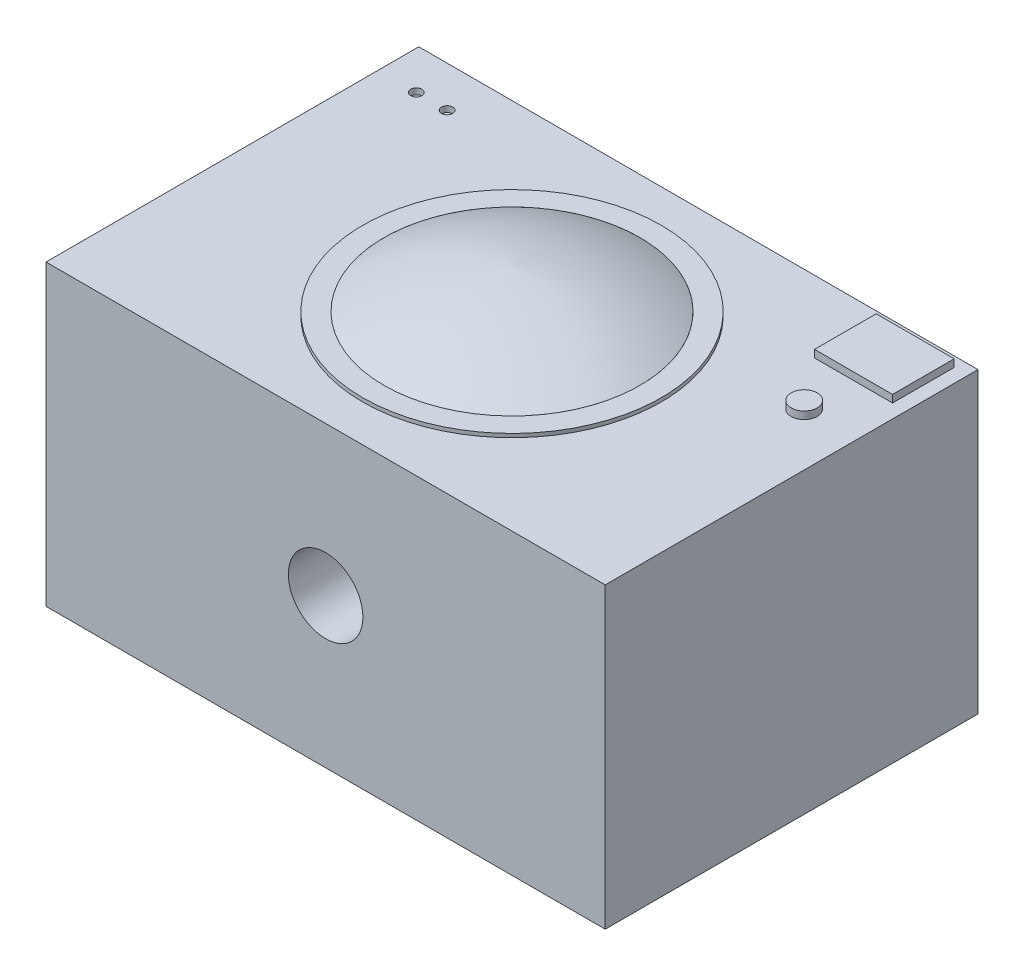
ISO-10303-21;
HEADER;
FILE_DESCRIPTION(('STEP AP214'),'2;1');
FILE_NAME('part.step','',(''),(''),'','','');
FILE_SCHEMA(('AUTOMOTIVE_DESIGN { 1 0 10303 214 1 1 1 1 }'));
ENDSEC;
DATA;
#1=APPLICATION_CONTEXT('core data for automotive mechanical design processes');
#2=APPLICATION_PROTOCOL_DEFINITION('international standard','automotive_design',2000,#1);
#3=PRODUCT_CONTEXT('',#1,'mechanical');
#4=PRODUCT('Part','Part','',(#3));
#5=PRODUCT_RELATED_PRODUCT_CATEGORY('part','',(#4));
#6=PRODUCT_DEFINITION_FORMATION('','',#4);
#7=PRODUCT_DEFINITION_CONTEXT('part definition',#1,'design');
#8=PRODUCT_DEFINITION('design','',#6,#7);
#9=PRODUCT_DEFINITION_SHAPE('','',#8);
#10=(LENGTH_UNIT() NAMED_UNIT(*) SI_UNIT(.MILLI.,.METRE.));
#11=(NAMED_UNIT(*) PLANE_ANGLE_UNIT() SI_UNIT($,.RADIAN.));
#12=(NAMED_UNIT(*) SI_UNIT($,.STERADIAN.) SOLID_ANGLE_UNIT());
#13=UNCERTAINTY_MEASURE_WITH_UNIT(LENGTH_MEASURE(1.E-05),#10,'distance_accuracy_value','');
#14=(GEOMETRIC_REPRESENTATION_CONTEXT(3) GLOBAL_UNCERTAINTY_ASSIGNED_CONTEXT((#13)) GLOBAL_UNIT_ASSIGNED_CONTEXT((#10,
#11,#12)) REPRESENTATION_CONTEXT('',''));
#15=CARTESIAN_POINT('',(0.,0.,0.));
#16=DIRECTION('',(0.,0.,1.));
#17=DIRECTION('',(1.,0.,0.));
#18=AXIS2_PLACEMENT_3D('',#15,#16,#17);
#19=CARTESIAN_POINT('',(0.,40.,0.));
#20=DIRECTION('',(0.,1.,0.));
#21=DIRECTION('',(0.,0.,1.));
#22=AXIS2_PLACEMENT_3D('',#19,#20,#21);
#23=CONICAL_SURFACE('',#22,0.,1.54167896286986);
#24=CARTESIAN_POINT('',(0.,40.5,0.));
#25=DIRECTION('',(0.,-1.,0.));
#26=DIRECTION('',(0.,0.,-1.));
#27=AXIS2_PLACEMENT_3D('',#24,#25,#26);
#28=CIRCLE('',#27,17.1670309791528);
#29=CARTESIAN_POINT('',(0.,40.5,-17.1670309791528));
#30=VERTEX_POINT('',#29);
#31=EDGE_CURVE('E12',#30,#30,#28,.T.);
#32=ORIENTED_EDGE('',*,*,#31,.T.);
#33=EDGE_LOOP('',(#32));
#34=FACE_BOUND('',#33,.T.);
#35=CARTESIAN_POINT('',(0.,40.,0.));
#36=VERTEX_POINT('',#35);
#37=VERTEX_LOOP('',#36);
#38=FACE_BOUND('',#37,.T.);
#39=ADVANCED_FACE('F44',(#34,#38),#23,.T.);
#40=CARTESIAN_POINT('',(0.,5.53865891644741,2.65672331871384));
#41=DIRECTION('',(-1.,0.,0.));
#42=DIRECTION('',(0.,0.,-1.));
#43=AXIS2_PLACEMENT_3D('',#40,#41,#42);
#44=CIRCLE('',#43,40.1905039135203);
#45=TRIMMED_CURVE('',#44,(PARAMETER_VALUE(-1.50464483090823)),
(PARAMETER_VALUE(1.50464483090823)),.T.,.PARAMETER.);
#46=CARTESIAN_POINT('',(0.,5.53865891644741,0.));
#47=DIRECTION('',(0.,-1.,0.));
#48=AXIS1_PLACEMENT('',#46,#47);
#49=SURFACE_OF_REVOLUTION('',#45,#48);
#50=CARTESIAN_POINT('',(0.,45.6412576605499,0.));
#51=VERTEX_POINT('',#50);
#52=VERTEX_LOOP('',#51);
#53=FACE_BOUND('',#52,.T.);
#54=ORIENTED_EDGE('',*,*,#31,.F.);
#55=EDGE_LOOP('',(#54));
#56=FACE_BOUND('',#55,.T.);
#57=ADVANCED_FACE('F55',(#53,#56),#49,.T.);
#58=CLOSED_SHELL('',(#39,#57));
#59=MANIFOLD_SOLID_BREP('B2',#58);
#60=CARTESIAN_POINT('',(0.,40.,0.));
#61=DIRECTION('',(0.,1.,0.));
#62=DIRECTION('',(0.,0.,1.));
#63=AXIS2_PLACEMENT_3D('',#60,#61,#62);
#64=PLANE('',#63);
#65=CARTESIAN_POINT('',(-32.3631246774455,40.,-19.5273741004889));
#66=DIRECTION('',(0.,1.,0.));
#67=DIRECTION('',(0.,0.,1.));
#68=AXIS2_PLACEMENT_3D('',#65,#66,#67);
#69=CIRCLE('',#68,0.749999999999999);
#70=CARTESIAN_POINT('',(-32.3631246774455,40.,-18.7773741004889));
#71=VERTEX_POINT('',#70);
#72=EDGE_CURVE('E380',#71,#71,#69,.T.);
#73=ORIENTED_EDGE('',*,*,#72,.F.);
#74=EDGE_LOOP('',(#73));
#75=FACE_BOUND('',#74,.T.);
#76=CARTESIAN_POINT('',(-28.2264846810803,40.,-19.5273741004889));
#77=DIRECTION('',(0.,1.,0.));
#78=DIRECTION('',(0.,0.,1.));
#79=AXIS2_PLACEMENT_3D('',#76,#77,#78);
#80=CIRCLE('',#79,0.750000000000002);
#81=CARTESIAN_POINT('',(-28.2264846810803,40.,-18.7773741004889));
#82=VERTEX_POINT('',#81);
#83=EDGE_CURVE('E369',#82,#82,#80,.T.);
#84=ORIENTED_EDGE('',*,*,#83,.F.);
#85=EDGE_LOOP('',(#84));
#86=FACE_BOUND('',#85,.T.);
#87=CARTESIAN_POINT('',(30.416470561509,40.,-8.77425715492008));
#88=DIRECTION('',(0.,1.,0.));
#89=DIRECTION('',(0.,0.,1.));
#90=AXIS2_PLACEMENT_3D('',#87,#88,#89);
#91=CIRCLE('',#90,1.75);
#92=CARTESIAN_POINT('',(30.416470561509,40.,-7.02425715492007));
#93=VERTEX_POINT('',#92);
#94=EDGE_CURVE('E379',#93,#93,#91,.T.);
#95=ORIENTED_EDGE('',*,*,#94,.F.);
#96=EDGE_LOOP('',(#95));
#97=FACE_BOUND('',#96,.T.);
#98=CARTESIAN_POINT('',(0.,40.,0.));
#99=DIRECTION('',(0.,1.,0.));
#100=DIRECTION('',(0.,0.,1.));
#101=AXIS2_PLACEMENT_3D('',#98,#99,#100);
#102=CIRCLE('',#101,20.0265797079087);
#103=CARTESIAN_POINT('',(0.,40.,20.0265797079087));
#104=VERTEX_POINT('',#103);
#105=EDGE_CURVE('E429',#104,#104,#102,.T.);
#106=ORIENTED_EDGE('',*,*,#105,.F.);
#107=EDGE_LOOP('',(#106));
#108=FACE_BOUND('',#107,.T.);
#109=DIRECTION('',(0.,0.,-1.));
#110=VECTOR('',#109,1.);
#111=CARTESIAN_POINT('',(37.5,40.,-25.));
#112=LINE('',#111,#110);
#113=CARTESIAN_POINT('',(37.5,40.,25.));
#114=VERTEX_POINT('',#113);
#115=CARTESIAN_POINT('',(37.5,40.,-25.));
#116=VERTEX_POINT('',#115);
#117=EDGE_CURVE('E436',#114,#116,#112,.T.);
#118=ORIENTED_EDGE('',*,*,#117,.T.);
#119=DIRECTION('',(-1.,0.,0.));
#120=VECTOR('',#119,1.);
#121=CARTESIAN_POINT('',(-37.5,40.,-25.));
#122=LINE('',#121,#120);
#123=CARTESIAN_POINT('',(-37.5,40.,-25.));
#124=VERTEX_POINT('',#123);
#125=EDGE_CURVE('E439',#116,#124,#122,.T.);
#126=ORIENTED_EDGE('',*,*,#125,.T.);
#127=DIRECTION('',(0.,0.,1.));
#128=VECTOR('',#127,1.);
#129=CARTESIAN_POINT('',(-37.5,40.,-25.));
#130=LINE('',#129,#128);
#131=CARTESIAN_POINT('',(-37.5,40.,25.));
#132=VERTEX_POINT('',#131);
#133=EDGE_CURVE('E442',#124,#132,#130,.T.);
#134=ORIENTED_EDGE('',*,*,#133,.T.);
#135=DIRECTION('',(1.,0.,0.));
#136=VECTOR('',#135,1.);
#137=CARTESIAN_POINT('',(-37.5,40.,25.));
#138=LINE('',#137,#136);
#139=EDGE_CURVE('E444',#132,#114,#138,.T.);
#140=ORIENTED_EDGE('',*,*,#139,.T.);
#141=EDGE_LOOP('',(#118,#126,#134,#140));
#142=FACE_BOUND('',#141,.T.);
#143=DIRECTION('',(0.,0.,-1.));
#144=VECTOR('',#143,1.);
#145=CARTESIAN_POINT('',(35.6481034980885,40.,0.));
#146=LINE('',#145,#144);
#147=CARTESIAN_POINT('',(35.6481034980885,40.,-15.3907341041236));
#148=VERTEX_POINT('',#147);
#149=CARTESIAN_POINT('',(35.6481034980885,40.,-23.6640140968541));
#150=VERTEX_POINT('',#149);
#151=EDGE_CURVE('E409',#148,#150,#146,.T.);
#152=ORIENTED_EDGE('',*,*,#151,.F.);
#153=DIRECTION('',(1.,0.,0.));
#154=VECTOR('',#153,1.);
#155=CARTESIAN_POINT('',(0.,40.,-15.3907341041236));
#156=LINE('',#155,#154);
#157=CARTESIAN_POINT('',(25.1848376249294,40.,-15.3907341041236));
#158=VERTEX_POINT('',#157);
#159=EDGE_CURVE('E391',#158,#148,#156,.T.);
#160=ORIENTED_EDGE('',*,*,#159,.F.);
#161=DIRECTION('',(0.,0.,-1.));
#162=VECTOR('',#161,1.);
#163=CARTESIAN_POINT('',(25.1848376249294,40.,0.));
#164=LINE('',#163,#162);
#165=CARTESIAN_POINT('',(25.1848376249294,40.,-23.6640140968541));
#166=VERTEX_POINT('',#165);
#167=EDGE_CURVE('E398',#158,#166,#164,.T.);
#168=ORIENTED_EDGE('',*,*,#167,.T.);
#169=DIRECTION('',(1.,0.,0.));
#170=VECTOR('',#169,1.);
#171=CARTESIAN_POINT('',(0.,40.,-23.6640140968541));
#172=LINE('',#171,#170);
#173=EDGE_CURVE('E412',#166,#150,#172,.T.);
#174=ORIENTED_EDGE('',*,*,#173,.T.);
#175=EDGE_LOOP('',(#152,#160,#168,#174));
#176=FACE_BOUND('',#175,.T.);
#177=ADVANCED_FACE('F75',(#75,#86,#97,#108,#142,#176),#64,.T.);
#178=CARTESIAN_POINT('',(37.5,40.,-25.));
#179=DIRECTION('',(-1.,0.,0.));
#180=DIRECTION('',(0.,0.,1.));
#181=AXIS2_PLACEMENT_3D('',#178,#179,#180);
#182=PLANE('',#181);
#183=DIRECTION('',(0.,0.,-1.));
#184=VECTOR('',#183,1.);
#185=CARTESIAN_POINT('',(37.5,0.,-25.));
#186=LINE('',#185,#184);
#187=CARTESIAN_POINT('',(37.5,0.,25.));
#188=VERTEX_POINT('',#187);
#189=CARTESIAN_POINT('',(37.5,0.,-25.));
#190=VERTEX_POINT('',#189);
#191=EDGE_CURVE('E433',#188,#190,#186,.T.);
#192=ORIENTED_EDGE('',*,*,#191,.T.);
#193=DIRECTION('',(0.,-1.,0.));
#194=VECTOR('',#193,1.);
#195=CARTESIAN_POINT('',(37.5,40.,-25.));
#196=LINE('',#195,#194);
#197=EDGE_CURVE('E83',#116,#190,#196,.T.);
#198=ORIENTED_EDGE('',*,*,#197,.F.);
#199=ORIENTED_EDGE('',*,*,#117,.F.);
#200=DIRECTION('',(0.,-1.,0.));
#201=VECTOR('',#200,1.);
#202=CARTESIAN_POINT('',(37.5,40.,25.));
#203=LINE('',#202,#201);
#204=EDGE_CURVE('E446',#114,#188,#203,.T.);
#205=ORIENTED_EDGE('',*,*,#204,.T.);
#206=EDGE_LOOP('',(#192,#198,#199,#205));
#207=FACE_BOUND('',#206,.T.);
#208=ADVANCED_FACE('F77',(#207),#182,.F.);
#209=CARTESIAN_POINT('',(-37.5,40.,-25.));
#210=DIRECTION('',(0.,0.,1.));
#211=DIRECTION('',(1.,0.,0.));
#212=AXIS2_PLACEMENT_3D('',#209,#210,#211);
#213=PLANE('',#212);
#214=DIRECTION('',(1.,0.,0.));
#215=VECTOR('',#214,1.);
#216=CARTESIAN_POINT('',(36.7430964383028,6.21323590369122,-25.));
#217=LINE('',#216,#215);
#218=CARTESIAN_POINT('',(-36.7430964383028,6.21323590369122,-25.));
#219=VERTEX_POINT('',#218);
#220=CARTESIAN_POINT('',(36.7430964383028,6.21323590369122,-25.));
#221=VERTEX_POINT('',#220);
#222=EDGE_CURVE('E297',#219,#221,#217,.T.);
#223=ORIENTED_EDGE('',*,*,#222,.F.);
#224=DIRECTION('',(0.,1.,0.));
#225=VECTOR('',#224,1.);
#226=CARTESIAN_POINT('',(-36.7430964383028,5.23990884572295,-25.));
#227=LINE('',#226,#225);
#228=CARTESIAN_POINT('',(-36.7430964383028,5.23990884572295,-25.));
#229=VERTEX_POINT('',#228);
#230=EDGE_CURVE('E98',#229,#219,#227,.T.);
#231=ORIENTED_EDGE('',*,*,#230,.F.);
#232=DIRECTION('',(-1.,0.,0.));
#233=VECTOR('',#232,1.);
#234=CARTESIAN_POINT('',(36.7430964383028,5.23990884572295,-25.));
#235=LINE('',#234,#233);
#236=CARTESIAN_POINT('',(36.7430964383028,5.23990884572295,-25.));
#237=VERTEX_POINT('',#236);
#238=EDGE_CURVE('E286',#237,#229,#235,.T.);
#239=ORIENTED_EDGE('',*,*,#238,.F.);
#240=DIRECTION('',(0.,-1.,0.));
#241=VECTOR('',#240,1.);
#242=CARTESIAN_POINT('',(36.7430964383028,5.23990884572295,-25.));
#243=LINE('',#242,#241);
#244=EDGE_CURVE('E301',#221,#237,#243,.T.);
#245=ORIENTED_EDGE('',*,*,#244,.F.);
#246=EDGE_LOOP('',(#223,#231,#239,#245));
#247=FACE_BOUND('',#246,.T.);
#248=DIRECTION('',(-1.,0.,0.));
#249=VECTOR('',#248,1.);
#250=CARTESIAN_POINT('',(34.2807222457032,6.93276215958801,-25.));
#251=LINE('',#250,#249);
#252=CARTESIAN_POINT('',(34.2807222457032,6.93276215958801,-25.));
#253=VERTEX_POINT('',#252);
#254=CARTESIAN_POINT('',(15.3504714718765,6.93276215958801,-25.));
#255=VERTEX_POINT('',#254);
#256=EDGE_CURVE('E329',#253,#255,#251,.T.);
#257=ORIENTED_EDGE('',*,*,#256,.F.);
#258=DIRECTION('',(0.,-1.,0.));
#259=VECTOR('',#258,1.);
#260=CARTESIAN_POINT('',(34.2807222457032,6.93276215958801,-25.));
#261=LINE('',#260,#259);
#262=CARTESIAN_POINT('',(34.2807222457032,14.9361846386489,-25.));
#263=VERTEX_POINT('',#262);
#264=EDGE_CURVE('E278',#263,#253,#261,.T.);
#265=ORIENTED_EDGE('',*,*,#264,.F.);
#266=DIRECTION('',(1.,0.,0.));
#267=VECTOR('',#266,1.);
#268=CARTESIAN_POINT('',(34.2807222457032,14.9361846386489,-25.));
#269=LINE('',#268,#267);
#270=CARTESIAN_POINT('',(15.3504714718765,14.9361846386489,-25.));
#271=VERTEX_POINT('',#270);
#272=EDGE_CURVE('E318',#271,#263,#269,.T.);
#273=ORIENTED_EDGE('',*,*,#272,.F.);
#274=DIRECTION('',(0.,1.,0.));
#275=VECTOR('',#274,1.);
#276=CARTESIAN_POINT('',(15.3504714718765,6.93276215958801,-25.));
#277=LINE('',#276,#275);
#278=EDGE_CURVE('E332',#255,#271,#277,.T.);
#279=ORIENTED_EDGE('',*,*,#278,.F.);
#280=EDGE_LOOP('',(#257,#265,#273,#279));
#281=FACE_BOUND('',#280,.T.);
#282=DIRECTION('',(-1.,0.,0.));
#283=VECTOR('',#282,1.);
#284=CARTESIAN_POINT('',(-37.5,0.,-25.));
#285=LINE('',#284,#283);
#286=CARTESIAN_POINT('',(-37.5,0.,-25.));
#287=VERTEX_POINT('',#286);
#288=EDGE_CURVE('E449',#190,#287,#285,.T.);
#289=ORIENTED_EDGE('',*,*,#288,.T.);
#290=DIRECTION('',(0.,-1.,0.));
#291=VECTOR('',#290,1.);
#292=CARTESIAN_POINT('',(-37.5,40.,-25.));
#293=LINE('',#292,#291);
#294=EDGE_CURVE('E459',#124,#287,#293,.T.);
#295=ORIENTED_EDGE('',*,*,#294,.F.);
#296=ORIENTED_EDGE('',*,*,#125,.F.);
#297=ORIENTED_EDGE('',*,*,#197,.T.);
#298=EDGE_LOOP('',(#289,#295,#296,#297));
#299=FACE_BOUND('',#298,.T.);
#300=ADVANCED_FACE('F464',(#247,#281,#299),#213,.F.);
#301=CARTESIAN_POINT('',(-37.5,40.,-25.));
#302=DIRECTION('',(1.,0.,0.));
#303=DIRECTION('',(0.,0.,-1.));
#304=AXIS2_PLACEMENT_3D('',#301,#302,#303);
#305=PLANE('',#304);
#306=DIRECTION('',(0.,0.,1.));
#307=VECTOR('',#306,1.);
#308=CARTESIAN_POINT('',(-37.5,12.9994691050974,-23.6665995328675));
#309=LINE('',#308,#307);
#310=CARTESIAN_POINT('',(-37.5,12.9994691050974,-23.6665995328675));
#311=VERTEX_POINT('',#310);
#312=CARTESIAN_POINT('',(-37.5,12.9994691050974,23.474967147986));
#313=VERTEX_POINT('',#312);
#314=EDGE_CURVE('E271',#311,#313,#309,.T.);
#315=ORIENTED_EDGE('',*,*,#314,.F.);
#316=DIRECTION('',(0.,-1.,0.));
#317=VECTOR('',#316,1.);
#318=CARTESIAN_POINT('',(-37.5,25.4555741223961,-23.6665995328675));
#319=LINE('',#318,#317);
#320=CARTESIAN_POINT('',(-37.5,25.4555741223961,-23.6665995328675));
#321=VERTEX_POINT('',#320);
#322=EDGE_CURVE('E90',#321,#311,#319,.T.);
#323=ORIENTED_EDGE('',*,*,#322,.F.);
#324=DIRECTION('',(0.,0.,-1.));
#325=VECTOR('',#324,1.);
#326=CARTESIAN_POINT('',(-37.5,25.4555741223961,-23.6665995328675));
#327=LINE('',#326,#325);
#328=CARTESIAN_POINT('',(-37.5,25.4555741223961,23.474967147986));
#329=VERTEX_POINT('',#328);
#330=EDGE_CURVE('E259',#329,#321,#327,.T.);
#331=ORIENTED_EDGE('',*,*,#330,.F.);
#332=DIRECTION('',(0.,1.,0.));
#333=VECTOR('',#332,1.);
#334=CARTESIAN_POINT('',(-37.5,25.4555741223961,23.474967147986));
#335=LINE('',#334,#333);
#336=EDGE_CURVE('E262',#313,#329,#335,.T.);
#337=ORIENTED_EDGE('',*,*,#336,.F.);
#338=EDGE_LOOP('',(#315,#323,#331,#337));
#339=FACE_BOUND('',#338,.T.);
#340=DIRECTION('',(0.,0.,1.));
#341=VECTOR('',#340,1.);
#342=CARTESIAN_POINT('',(-37.5,0.,-25.));
#343=LINE('',#342,#341);
#344=CARTESIAN_POINT('',(-37.5,0.,25.));
#345=VERTEX_POINT('',#344);
#346=EDGE_CURVE('E451',#287,#345,#343,.T.);
#347=ORIENTED_EDGE('',*,*,#346,.T.);
#348=DIRECTION('',(0.,-1.,0.));
#349=VECTOR('',#348,1.);
#350=CARTESIAN_POINT('',(-37.5,40.,25.));
#351=LINE('',#350,#349);
#352=EDGE_CURVE('E456',#132,#345,#351,.T.);
#353=ORIENTED_EDGE('',*,*,#352,.F.);
#354=ORIENTED_EDGE('',*,*,#133,.F.);
#355=ORIENTED_EDGE('',*,*,#294,.T.);
#356=EDGE_LOOP('',(#347,#353,#354,#355));
#357=FACE_BOUND('',#356,.T.);
#358=ADVANCED_FACE('F476',(#339,#357),#305,.F.);
#359=CARTESIAN_POINT('',(-37.5,40.,25.));
#360=DIRECTION('',(0.,0.,-1.));
#361=DIRECTION('',(-1.,0.,0.));
#362=AXIS2_PLACEMENT_3D('',#359,#360,#361);
#363=PLANE('',#362);
#364=CARTESIAN_POINT('',(0.,20.,25.));
#365=DIRECTION('',(0.,0.,1.));
#366=DIRECTION('',(1.,0.,0.));
#367=AXIS2_PLACEMENT_3D('',#364,#365,#366);
#368=CIRCLE('',#367,5.);
#369=CARTESIAN_POINT('',(4.99999999999999,20.,25.));
#370=VERTEX_POINT('',#369);
#371=EDGE_CURVE('E265',#370,#370,#368,.T.);
#372=ORIENTED_EDGE('',*,*,#371,.F.);
#373=EDGE_LOOP('',(#372));
#374=FACE_BOUND('',#373,.T.);
#375=DIRECTION('',(1.,0.,0.));
#376=VECTOR('',#375,1.);
#377=CARTESIAN_POINT('',(-37.5,0.,25.));
#378=LINE('',#377,#376);
#379=EDGE_CURVE('E440',#345,#188,#378,.T.);
#380=ORIENTED_EDGE('',*,*,#379,.T.);
#381=ORIENTED_EDGE('',*,*,#204,.F.);
#382=ORIENTED_EDGE('',*,*,#139,.F.);
#383=ORIENTED_EDGE('',*,*,#352,.T.);
#384=EDGE_LOOP('',(#380,#381,#382,#383));
#385=FACE_BOUND('',#384,.T.);
#386=ADVANCED_FACE('F480',(#374,#385),#363,.F.);
#387=CARTESIAN_POINT('',(0.,0.,0.));
#388=DIRECTION('',(0.,1.,0.));
#389=DIRECTION('',(0.,0.,1.));
#390=AXIS2_PLACEMENT_3D('',#387,#388,#389);
#391=PLANE('',#390);
#392=DIRECTION('',(-1.,0.,0.));
#393=VECTOR('',#392,1.);
#394=CARTESIAN_POINT('',(-34.5522876596546,0.,15.7957752232635));
#395=LINE('',#394,#393);
#396=CARTESIAN_POINT('',(34.5522876596546,0.,15.7957752232635));
#397=VERTEX_POINT('',#396);
#398=CARTESIAN_POINT('',(-34.5522876596546,0.,15.7957752232635));
#399=VERTEX_POINT('',#398);
#400=EDGE_CURVE('E359',#397,#399,#395,.T.);
#401=ORIENTED_EDGE('',*,*,#400,.F.);
#402=DIRECTION('',(0.,0.,1.));
#403=VECTOR('',#402,1.);
#404=CARTESIAN_POINT('',(34.5522876596546,0.,-15.7957752232635));
#405=LINE('',#404,#403);
#406=CARTESIAN_POINT('',(34.5522876596546,0.,-15.7957752232635));
#407=VERTEX_POINT('',#406);
#408=EDGE_CURVE('E308',#407,#397,#405,.T.);
#409=ORIENTED_EDGE('',*,*,#408,.F.);
#410=DIRECTION('',(1.,0.,0.));
#411=VECTOR('',#410,1.);
#412=CARTESIAN_POINT('',(-34.5522876596546,0.,-15.7957752232635));
#413=LINE('',#412,#411);
#414=CARTESIAN_POINT('',(-34.5522876596546,0.,-15.7957752232635));
#415=VERTEX_POINT('',#414);
#416=EDGE_CURVE('E348',#415,#407,#413,.T.);
#417=ORIENTED_EDGE('',*,*,#416,.F.);
#418=DIRECTION('',(0.,0.,-1.));
#419=VECTOR('',#418,1.);
#420=CARTESIAN_POINT('',(-34.5522876596546,0.,-15.7957752232635));
#421=LINE('',#420,#419);
#422=EDGE_CURVE('E362',#399,#415,#421,.T.);
#423=ORIENTED_EDGE('',*,*,#422,.F.);
#424=EDGE_LOOP('',(#401,#409,#417,#423));
#425=FACE_BOUND('',#424,.T.);
#426=ORIENTED_EDGE('',*,*,#191,.F.);
#427=ORIENTED_EDGE('',*,*,#379,.F.);
#428=ORIENTED_EDGE('',*,*,#346,.F.);
#429=ORIENTED_EDGE('',*,*,#288,.F.);
#430=EDGE_LOOP('',(#426,#427,#428,#429));
#431=FACE_BOUND('',#430,.T.);
#432=ADVANCED_FACE('F472',(#425,#431),#391,.F.);
#433=CARTESIAN_POINT('',(0.,40.5,0.));
#434=DIRECTION('',(0.,1.,0.));
#435=DIRECTION('',(0.,0.,1.));
#436=AXIS2_PLACEMENT_3D('',#433,#434,#435);
#437=PLANE('',#436);
#438=CARTESIAN_POINT('',(0.,40.5,0.));
#439=DIRECTION('',(0.,1.,0.));
#440=DIRECTION('',(0.,0.,1.));
#441=AXIS2_PLACEMENT_3D('',#438,#439,#440);
#442=CIRCLE('',#441,20.0265797079087);
#443=CARTESIAN_POINT('',(0.,40.5,20.0265797079087));
#444=VERTEX_POINT('',#443);
#445=EDGE_CURVE('E430',#444,#444,#442,.T.);
#446=ORIENTED_EDGE('',*,*,#445,.T.);
#447=EDGE_LOOP('',(#446));
#448=FACE_BOUND('',#447,.T.);
#449=CARTESIAN_POINT('',(0.,40.5,0.));
#450=DIRECTION('',(0.,1.,0.));
#451=DIRECTION('',(0.,0.,1.));
#452=AXIS2_PLACEMENT_3D('',#449,#450,#451);
#453=CIRCLE('',#452,17.1670309791528);
#454=CARTESIAN_POINT('',(0.,40.5,17.1670309791528));
#455=VERTEX_POINT('',#454);
#456=EDGE_CURVE('E426',#455,#455,#453,.T.);
#457=ORIENTED_EDGE('',*,*,#456,.F.);
#458=EDGE_LOOP('',(#457));
#459=FACE_BOUND('',#458,.T.);
#460=ADVANCED_FACE('F528',(#448,#459),#437,.T.);
#461=CARTESIAN_POINT('',(0.,40.5,0.));
#462=DIRECTION('',(0.,-1.,0.));
#463=DIRECTION('',(0.,0.,-1.));
#464=AXIS2_PLACEMENT_3D('',#461,#462,#463);
#465=CYLINDRICAL_SURFACE('',#464,20.0265797079087);
#466=ORIENTED_EDGE('',*,*,#445,.F.);
#467=EDGE_LOOP('',(#466));
#468=FACE_BOUND('',#467,.T.);
#469=ORIENTED_EDGE('',*,*,#105,.T.);
#470=EDGE_LOOP('',(#469));
#471=FACE_BOUND('',#470,.T.);
#472=ADVANCED_FACE('F526',(#468,#471),#465,.T.);
#473=CARTESIAN_POINT('',(0.,40.5,0.));
#474=DIRECTION('',(0.,-1.,0.));
#475=DIRECTION('',(0.,0.,-1.));
#476=AXIS2_PLACEMENT_3D('',#473,#474,#475);
#477=CYLINDRICAL_SURFACE('',#476,17.1670309791528);
#478=ORIENTED_EDGE('',*,*,#456,.T.);
#479=EDGE_LOOP('',(#478));
#480=FACE_BOUND('',#479,.T.);
#481=CARTESIAN_POINT('',(0.,40.,0.));
#482=DIRECTION('',(0.,1.,0.));
#483=DIRECTION('',(0.,0.,1.));
#484=AXIS2_PLACEMENT_3D('',#481,#482,#483);
#485=CIRCLE('',#484,17.1670309791528);
#486=CARTESIAN_POINT('',(0.,40.,17.1670309791528));
#487=VERTEX_POINT('',#486);
#488=EDGE_CURVE('E42',#487,#487,#485,.F.);
#489=ORIENTED_EDGE('',*,*,#488,.T.);
#490=EDGE_LOOP('',(#489));
#491=FACE_BOUND('',#490,.T.);
#492=ADVANCED_FACE('F523',(#480,#491),#477,.F.);
#493=CARTESIAN_POINT('',(0.,40.,0.));
#494=VERTEX_POINT('',#493);
#495=VERTEX_LOOP('',#494);
#496=FACE_BOUND('',#495,.T.);
#497=ORIENTED_EDGE('',*,*,#488,.F.);
#498=EDGE_LOOP('',(#497));
#499=FACE_BOUND('',#498,.T.);
#500=ADVANCED_FACE('F486',(#496,#499),#64,.T.);
#501=CARTESIAN_POINT('',(0.,41.,-15.3907341041236));
#502=DIRECTION('',(0.,0.,-1.));
#503=DIRECTION('',(-1.,0.,0.));
#504=AXIS2_PLACEMENT_3D('',#501,#502,#503);
#505=PLANE('',#504);
#506=ORIENTED_EDGE('',*,*,#159,.T.);
#507=DIRECTION('',(0.,-1.,0.));
#508=VECTOR('',#507,1.);
#509=CARTESIAN_POINT('',(35.6481034980885,41.,-15.3907341041236));
#510=LINE('',#509,#508);
#511=CARTESIAN_POINT('',(35.6481034980885,41.,-15.3907341041236));
#512=VERTEX_POINT('',#511);
#513=EDGE_CURVE('E423',#512,#148,#510,.T.);
#514=ORIENTED_EDGE('',*,*,#513,.F.);
#515=DIRECTION('',(1.,0.,0.));
#516=VECTOR('',#515,1.);
#517=CARTESIAN_POINT('',(0.,41.,-15.3907341041236));
#518=LINE('',#517,#516);
#519=CARTESIAN_POINT('',(25.1848376249294,41.,-15.3907341041236));
#520=VERTEX_POINT('',#519);
#521=EDGE_CURVE('E394',#520,#512,#518,.T.);
#522=ORIENTED_EDGE('',*,*,#521,.F.);
#523=DIRECTION('',(0.,-1.,0.));
#524=VECTOR('',#523,1.);
#525=CARTESIAN_POINT('',(25.1848376249294,41.,-15.3907341041236));
#526=LINE('',#525,#524);
#527=EDGE_CURVE('E406',#520,#158,#526,.T.);
#528=ORIENTED_EDGE('',*,*,#527,.T.);
#529=EDGE_LOOP('',(#506,#514,#522,#528));
#530=FACE_BOUND('',#529,.T.);
#531=ADVANCED_FACE('F494',(#530),#505,.F.);
#532=CARTESIAN_POINT('',(35.6481034980885,41.,0.));
#533=DIRECTION('',(-1.,0.,0.));
#534=DIRECTION('',(0.,0.,1.));
#535=AXIS2_PLACEMENT_3D('',#532,#533,#534);
#536=PLANE('',#535);
#537=ORIENTED_EDGE('',*,*,#151,.T.);
#538=DIRECTION('',(0.,-1.,0.));
#539=VECTOR('',#538,1.);
#540=CARTESIAN_POINT('',(35.6481034980885,41.,-23.6640140968541));
#541=LINE('',#540,#539);
#542=CARTESIAN_POINT('',(35.6481034980885,41.,-23.6640140968541));
#543=VERTEX_POINT('',#542);
#544=EDGE_CURVE('E420',#543,#150,#541,.T.);
#545=ORIENTED_EDGE('',*,*,#544,.F.);
#546=DIRECTION('',(0.,0.,-1.));
#547=VECTOR('',#546,1.);
#548=CARTESIAN_POINT('',(35.6481034980885,41.,0.));
#549=LINE('',#548,#547);
#550=EDGE_CURVE('E397',#512,#543,#549,.T.);
#551=ORIENTED_EDGE('',*,*,#550,.F.);
#552=ORIENTED_EDGE('',*,*,#513,.T.);
#553=EDGE_LOOP('',(#537,#545,#551,#552));
#554=FACE_BOUND('',#553,.T.);
#555=ADVANCED_FACE('F491',(#554),#536,.F.);
#556=CARTESIAN_POINT('',(0.,41.,-23.6640140968541));
#557=DIRECTION('',(0.,0.,-1.));
#558=DIRECTION('',(-1.,0.,0.));
#559=AXIS2_PLACEMENT_3D('',#556,#557,#558);
#560=PLANE('',#559);
#561=ORIENTED_EDGE('',*,*,#173,.F.);
#562=DIRECTION('',(0.,-1.,0.));
#563=VECTOR('',#562,1.);
#564=CARTESIAN_POINT('',(25.1848376249294,41.,-23.6640140968541));
#565=LINE('',#564,#563);
#566=CARTESIAN_POINT('',(25.1848376249294,41.,-23.6640140968541));
#567=VERTEX_POINT('',#566);
#568=EDGE_CURVE('E417',#567,#166,#565,.T.);
#569=ORIENTED_EDGE('',*,*,#568,.F.);
#570=DIRECTION('',(1.,0.,0.));
#571=VECTOR('',#570,1.);
#572=CARTESIAN_POINT('',(0.,41.,-23.6640140968541));
#573=LINE('',#572,#571);
#574=EDGE_CURVE('E400',#567,#543,#573,.T.);
#575=ORIENTED_EDGE('',*,*,#574,.T.);
#576=ORIENTED_EDGE('',*,*,#544,.T.);
#577=EDGE_LOOP('',(#561,#569,#575,#576));
#578=FACE_BOUND('',#577,.T.);
#579=ADVANCED_FACE('F501',(#578),#560,.T.);
#580=CARTESIAN_POINT('',(25.1848376249294,41.,0.));
#581=DIRECTION('',(-1.,0.,0.));
#582=DIRECTION('',(0.,0.,1.));
#583=AXIS2_PLACEMENT_3D('',#580,#581,#582);
#584=PLANE('',#583);
#585=ORIENTED_EDGE('',*,*,#167,.F.);
#586=ORIENTED_EDGE('',*,*,#527,.F.);
#587=DIRECTION('',(0.,0.,-1.));
#588=VECTOR('',#587,1.);
#589=CARTESIAN_POINT('',(25.1848376249294,41.,0.));
#590=LINE('',#589,#588);
#591=EDGE_CURVE('E403',#520,#567,#590,.T.);
#592=ORIENTED_EDGE('',*,*,#591,.T.);
#593=ORIENTED_EDGE('',*,*,#568,.T.);
#594=EDGE_LOOP('',(#585,#586,#592,#593));
#595=FACE_BOUND('',#594,.T.);
#596=ADVANCED_FACE('F498',(#595),#584,.T.);
#597=CARTESIAN_POINT('',(0.,41.,0.));
#598=DIRECTION('',(0.,1.,0.));
#599=DIRECTION('',(0.,0.,1.));
#600=AXIS2_PLACEMENT_3D('',#597,#598,#599);
#601=PLANE('',#600);
#602=ORIENTED_EDGE('',*,*,#521,.T.);
#603=ORIENTED_EDGE('',*,*,#550,.T.);
#604=ORIENTED_EDGE('',*,*,#574,.F.);
#605=ORIENTED_EDGE('',*,*,#591,.F.);
#606=EDGE_LOOP('',(#602,#603,#604,#605));
#607=FACE_BOUND('',#606,.T.);
#608=ADVANCED_FACE('F503',(#607),#601,.T.);
#609=CARTESIAN_POINT('',(30.416470561509,41.,-8.77425715492008));
#610=DIRECTION('',(0.,-1.,0.));
#611=DIRECTION('',(0.,0.,-1.));
#612=AXIS2_PLACEMENT_3D('',#609,#610,#611);
#613=CYLINDRICAL_SURFACE('',#612,1.75);
#614=CARTESIAN_POINT('',(30.416470561509,41.,-8.77425715492008));
#615=DIRECTION('',(0.,1.,0.));
#616=DIRECTION('',(0.,0.,1.));
#617=AXIS2_PLACEMENT_3D('',#614,#615,#616);
#618=CIRCLE('',#617,1.75);
#619=CARTESIAN_POINT('',(30.416470561509,41.,-7.02425715492007));
#620=VERTEX_POINT('',#619);
#621=EDGE_CURVE('E388',#620,#620,#618,.T.);
#622=ORIENTED_EDGE('',*,*,#621,.F.);
#623=EDGE_LOOP('',(#622));
#624=FACE_BOUND('',#623,.T.);
#625=ORIENTED_EDGE('',*,*,#94,.T.);
#626=EDGE_LOOP('',(#625));
#627=FACE_BOUND('',#626,.T.);
#628=ADVANCED_FACE('F505',(#624,#627),#613,.T.);
#629=CARTESIAN_POINT('',(0.,41.,0.));
#630=DIRECTION('',(0.,1.,0.));
#631=DIRECTION('',(0.,0.,1.));
#632=AXIS2_PLACEMENT_3D('',#629,#630,#631);
#633=PLANE('',#632);
#634=ORIENTED_EDGE('',*,*,#621,.T.);
#635=EDGE_LOOP('',(#634));
#636=FACE_BOUND('',#635,.T.);
#637=ADVANCED_FACE('F511',(#636),#633,.T.);
#638=CARTESIAN_POINT('',(-28.2264846810803,39.2,-19.5273741004889));
#639=DIRECTION('',(0.,1.,0.));
#640=DIRECTION('',(0.,0.,1.));
#641=AXIS2_PLACEMENT_3D('',#638,#639,#640);
#642=CYLINDRICAL_SURFACE('',#641,0.750000000000002);
#643=CARTESIAN_POINT('',(-28.2264846810803,39.2,-19.5273741004889));
#644=DIRECTION('',(0.,1.,0.));
#645=DIRECTION('',(0.,0.,1.));
#646=AXIS2_PLACEMENT_3D('',#643,#644,#645);
#647=CIRCLE('',#646,0.750000000000002);
#648=CARTESIAN_POINT('',(-28.2264846810803,39.2,-18.7773741004889));
#649=VERTEX_POINT('',#648);
#650=EDGE_CURVE('E383',#649,#649,#647,.T.);
#651=ORIENTED_EDGE('',*,*,#650,.F.);
#652=EDGE_LOOP('',(#651));
#653=FACE_BOUND('',#652,.T.);
#654=ORIENTED_EDGE('',*,*,#83,.T.);
#655=EDGE_LOOP('',(#654));
#656=FACE_BOUND('',#655,.T.);
#657=ADVANCED_FACE('F618',(#653,#656),#642,.F.);
#658=CARTESIAN_POINT('',(0.,39.2,0.));
#659=DIRECTION('',(0.,1.,0.));
#660=DIRECTION('',(0.,0.,1.));
#661=AXIS2_PLACEMENT_3D('',#658,#659,#660);
#662=PLANE('',#661);
#663=ORIENTED_EDGE('',*,*,#650,.T.);
#664=EDGE_LOOP('',(#663));
#665=FACE_BOUND('',#664,.T.);
#666=ADVANCED_FACE('F614',(#665),#662,.T.);
#667=CARTESIAN_POINT('',(-32.3631246774455,39.2,-19.5273741004889));
#668=DIRECTION('',(0.,1.,0.));
#669=DIRECTION('',(0.,0.,1.));
#670=AXIS2_PLACEMENT_3D('',#667,#668,#669);
#671=CYLINDRICAL_SURFACE('',#670,0.749999999999999);
#672=CARTESIAN_POINT('',(-32.3631246774455,39.2,-19.5273741004889));
#673=DIRECTION('',(0.,1.,0.));
#674=DIRECTION('',(0.,0.,1.));
#675=AXIS2_PLACEMENT_3D('',#672,#673,#674);
#676=CIRCLE('',#675,0.749999999999999);
#677=CARTESIAN_POINT('',(-32.3631246774455,39.2,-18.7773741004889));
#678=VERTEX_POINT('',#677);
#679=EDGE_CURVE('E376',#678,#678,#676,.T.);
#680=ORIENTED_EDGE('',*,*,#679,.F.);
#681=EDGE_LOOP('',(#680));
#682=FACE_BOUND('',#681,.T.);
#683=ORIENTED_EDGE('',*,*,#72,.T.);
#684=EDGE_LOOP('',(#683));
#685=FACE_BOUND('',#684,.T.);
#686=ADVANCED_FACE('F610',(#682,#685),#671,.F.);
#687=CARTESIAN_POINT('',(0.,39.2,0.));
#688=DIRECTION('',(0.,1.,0.));
#689=DIRECTION('',(0.,0.,1.));
#690=AXIS2_PLACEMENT_3D('',#687,#688,#689);
#691=PLANE('',#690);
#692=ORIENTED_EDGE('',*,*,#679,.T.);
#693=EDGE_LOOP('',(#692));
#694=FACE_BOUND('',#693,.T.);
#695=ADVANCED_FACE('F606',(#694),#691,.T.);
#696=CARTESIAN_POINT('',(34.5522876596546,0.3,-15.7957752232635));
#697=DIRECTION('',(1.,0.,0.));
#698=DIRECTION('',(0.,0.,-1.));
#699=AXIS2_PLACEMENT_3D('',#696,#697,#698);
#700=PLANE('',#699);
#701=ORIENTED_EDGE('',*,*,#408,.T.);
#702=DIRECTION('',(0.,-1.,0.));
#703=VECTOR('',#702,1.);
#704=CARTESIAN_POINT('',(34.5522876596546,0.3,15.7957752232635));
#705=LINE('',#704,#703);
#706=CARTESIAN_POINT('',(34.5522876596546,0.3,15.7957752232635));
#707=VERTEX_POINT('',#706);
#708=EDGE_CURVE('E357',#707,#397,#705,.T.);
#709=ORIENTED_EDGE('',*,*,#708,.F.);
#710=DIRECTION('',(0.,0.,1.));
#711=VECTOR('',#710,1.);
#712=CARTESIAN_POINT('',(34.5522876596546,0.3,-15.7957752232635));
#713=LINE('',#712,#711);
#714=CARTESIAN_POINT('',(34.5522876596546,0.3,-15.7957752232635));
#715=VERTEX_POINT('',#714);
#716=EDGE_CURVE('E344',#715,#707,#713,.T.);
#717=ORIENTED_EDGE('',*,*,#716,.F.);
#718=DIRECTION('',(0.,-1.,0.));
#719=VECTOR('',#718,1.);
#720=CARTESIAN_POINT('',(34.5522876596546,0.3,-15.7957752232635));
#721=LINE('',#720,#719);
#722=EDGE_CURVE('E367',#715,#407,#721,.T.);
#723=ORIENTED_EDGE('',*,*,#722,.T.);
#724=EDGE_LOOP('',(#701,#709,#717,#723));
#725=FACE_BOUND('',#724,.T.);
#726=ADVANCED_FACE('F596',(#725),#700,.F.);
#727=CARTESIAN_POINT('',(-34.5522876596546,0.3,-15.7957752232635));
#728=DIRECTION('',(0.,0.,-1.));
#729=DIRECTION('',(-1.,0.,0.));
#730=AXIS2_PLACEMENT_3D('',#727,#728,#729);
#731=PLANE('',#730);
#732=ORIENTED_EDGE('',*,*,#416,.T.);
#733=ORIENTED_EDGE('',*,*,#722,.F.);
#734=DIRECTION('',(1.,0.,0.));
#735=VECTOR('',#734,1.);
#736=CARTESIAN_POINT('',(-34.5522876596546,0.3,-15.7957752232635));
#737=LINE('',#736,#735);
#738=CARTESIAN_POINT('',(-34.5522876596546,0.3,-15.7957752232635));
#739=VERTEX_POINT('',#738);
#740=EDGE_CURVE('E354',#739,#715,#737,.T.);
#741=ORIENTED_EDGE('',*,*,#740,.F.);
#742=DIRECTION('',(0.,-1.,0.));
#743=VECTOR('',#742,1.);
#744=CARTESIAN_POINT('',(-34.5522876596546,0.3,-15.7957752232635));
#745=LINE('',#744,#743);
#746=EDGE_CURVE('E370',#739,#415,#745,.T.);
#747=ORIENTED_EDGE('',*,*,#746,.T.);
#748=EDGE_LOOP('',(#732,#733,#741,#747));
#749=FACE_BOUND('',#748,.T.);
#750=ADVANCED_FACE('F592',(#749),#731,.F.);
#751=CARTESIAN_POINT('',(-34.5522876596546,0.3,-15.7957752232635));
#752=DIRECTION('',(-1.,0.,0.));
#753=DIRECTION('',(0.,0.,1.));
#754=AXIS2_PLACEMENT_3D('',#751,#752,#753);
#755=PLANE('',#754);
#756=ORIENTED_EDGE('',*,*,#422,.T.);
#757=ORIENTED_EDGE('',*,*,#746,.F.);
#758=DIRECTION('',(0.,0.,-1.));
#759=VECTOR('',#758,1.);
#760=CARTESIAN_POINT('',(-34.5522876596546,0.3,-15.7957752232635));
#761=LINE('',#760,#759);
#762=CARTESIAN_POINT('',(-34.5522876596546,0.3,15.7957752232635));
#763=VERTEX_POINT('',#762);
#764=EDGE_CURVE('E351',#763,#739,#761,.T.);
#765=ORIENTED_EDGE('',*,*,#764,.F.);
#766=DIRECTION('',(0.,-1.,0.));
#767=VECTOR('',#766,1.);
#768=CARTESIAN_POINT('',(-34.5522876596546,0.3,15.7957752232635));
#769=LINE('',#768,#767);
#770=EDGE_CURVE('E372',#763,#399,#769,.T.);
#771=ORIENTED_EDGE('',*,*,#770,.T.);
#772=EDGE_LOOP('',(#756,#757,#765,#771));
#773=FACE_BOUND('',#772,.T.);
#774=ADVANCED_FACE('F595',(#773),#755,.F.);
#775=CARTESIAN_POINT('',(-34.5522876596546,0.3,15.7957752232635));
#776=DIRECTION('',(0.,0.,1.));
#777=DIRECTION('',(1.,0.,0.));
#778=AXIS2_PLACEMENT_3D('',#775,#776,#777);
#779=PLANE('',#778);
#780=ORIENTED_EDGE('',*,*,#400,.T.);
#781=ORIENTED_EDGE('',*,*,#770,.F.);
#782=DIRECTION('',(-1.,0.,0.));
#783=VECTOR('',#782,1.);
#784=CARTESIAN_POINT('',(-34.5522876596546,0.3,15.7957752232635));
#785=LINE('',#784,#783);
#786=EDGE_CURVE('E347',#707,#763,#785,.T.);
#787=ORIENTED_EDGE('',*,*,#786,.F.);
#788=ORIENTED_EDGE('',*,*,#708,.T.);
#789=EDGE_LOOP('',(#780,#781,#787,#788));
#790=FACE_BOUND('',#789,.T.);
#791=ADVANCED_FACE('F590',(#790),#779,.F.);
#792=CARTESIAN_POINT('',(0.,0.3,0.));
#793=DIRECTION('',(0.,1.,0.));
#794=DIRECTION('',(0.,0.,1.));
#795=AXIS2_PLACEMENT_3D('',#792,#793,#794);
#796=PLANE('',#795);
#797=ORIENTED_EDGE('',*,*,#716,.T.);
#798=ORIENTED_EDGE('',*,*,#786,.T.);
#799=ORIENTED_EDGE('',*,*,#764,.T.);
#800=ORIENTED_EDGE('',*,*,#740,.T.);
#801=EDGE_LOOP('',(#797,#798,#799,#800));
#802=FACE_BOUND('',#801,.T.);
#803=ADVANCED_FACE('F587',(#802),#796,.F.);
#804=CARTESIAN_POINT('',(34.2807222457032,6.93276215958801,-24.7));
#805=DIRECTION('',(1.,0.,0.));
#806=DIRECTION('',(0.,0.,-1.));
#807=AXIS2_PLACEMENT_3D('',#804,#805,#806);
#808=PLANE('',#807);
#809=ORIENTED_EDGE('',*,*,#264,.T.);
#810=DIRECTION('',(0.,0.,-1.));
#811=VECTOR('',#810,1.);
#812=CARTESIAN_POINT('',(34.2807222457032,6.93276215958801,-24.7));
#813=LINE('',#812,#811);
#814=CARTESIAN_POINT('',(34.2807222457032,6.93276215958801,-24.7));
#815=VERTEX_POINT('',#814);
#816=EDGE_CURVE('E327',#815,#253,#813,.T.);
#817=ORIENTED_EDGE('',*,*,#816,.F.);
#818=DIRECTION('',(0.,-1.,0.));
#819=VECTOR('',#818,1.);
#820=CARTESIAN_POINT('',(34.2807222457032,6.93276215958801,-24.7));
#821=LINE('',#820,#819);
#822=CARTESIAN_POINT('',(34.2807222457032,14.9361846386489,-24.7));
#823=VERTEX_POINT('',#822);
#824=EDGE_CURVE('E314',#823,#815,#821,.T.);
#825=ORIENTED_EDGE('',*,*,#824,.F.);
#826=DIRECTION('',(0.,0.,-1.));
#827=VECTOR('',#826,1.);
#828=CARTESIAN_POINT('',(34.2807222457032,14.9361846386489,-24.7));
#829=LINE('',#828,#827);
#830=EDGE_CURVE('E298',#823,#263,#829,.T.);
#831=ORIENTED_EDGE('',*,*,#830,.T.);
#832=EDGE_LOOP('',(#809,#817,#825,#831));
#833=FACE_BOUND('',#832,.T.);
#834=ADVANCED_FACE('F561',(#833),#808,.F.);
#835=CARTESIAN_POINT('',(34.2807222457032,14.9361846386489,-24.7));
#836=DIRECTION('',(0.,1.,0.));
#837=DIRECTION('',(0.,0.,1.));
#838=AXIS2_PLACEMENT_3D('',#835,#836,#837);
#839=PLANE('',#838);
#840=ORIENTED_EDGE('',*,*,#272,.T.);
#841=ORIENTED_EDGE('',*,*,#830,.F.);
#842=DIRECTION('',(1.,0.,0.));
#843=VECTOR('',#842,1.);
#844=CARTESIAN_POINT('',(34.2807222457032,14.9361846386489,-24.7));
#845=LINE('',#844,#843);
#846=CARTESIAN_POINT('',(15.3504714718765,14.9361846386489,-24.7));
#847=VERTEX_POINT('',#846);
#848=EDGE_CURVE('E324',#847,#823,#845,.T.);
#849=ORIENTED_EDGE('',*,*,#848,.F.);
#850=DIRECTION('',(0.,0.,-1.));
#851=VECTOR('',#850,1.);
#852=CARTESIAN_POINT('',(15.3504714718765,14.9361846386489,-24.7));
#853=LINE('',#852,#851);
#854=EDGE_CURVE('E338',#847,#271,#853,.T.);
#855=ORIENTED_EDGE('',*,*,#854,.T.);
#856=EDGE_LOOP('',(#840,#841,#849,#855));
#857=FACE_BOUND('',#856,.T.);
#858=ADVANCED_FACE('F564',(#857),#839,.F.);
#859=CARTESIAN_POINT('',(15.3504714718765,6.93276215958801,-24.7));
#860=DIRECTION('',(-1.,0.,0.));
#861=DIRECTION('',(0.,0.,1.));
#862=AXIS2_PLACEMENT_3D('',#859,#860,#861);
#863=PLANE('',#862);
#864=ORIENTED_EDGE('',*,*,#278,.T.);
#865=ORIENTED_EDGE('',*,*,#854,.F.);
#866=DIRECTION('',(0.,1.,0.));
#867=VECTOR('',#866,1.);
#868=CARTESIAN_POINT('',(15.3504714718765,6.93276215958801,-24.7));
#869=LINE('',#868,#867);
#870=CARTESIAN_POINT('',(15.3504714718765,6.93276215958801,-24.7));
#871=VERTEX_POINT('',#870);
#872=EDGE_CURVE('E321',#871,#847,#869,.T.);
#873=ORIENTED_EDGE('',*,*,#872,.F.);
#874=DIRECTION('',(0.,0.,-1.));
#875=VECTOR('',#874,1.);
#876=CARTESIAN_POINT('',(15.3504714718765,6.93276215958801,-24.7));
#877=LINE('',#876,#875);
#878=EDGE_CURVE('E340',#871,#255,#877,.T.);
#879=ORIENTED_EDGE('',*,*,#878,.T.);
#880=EDGE_LOOP('',(#864,#865,#873,#879));
#881=FACE_BOUND('',#880,.T.);
#882=ADVANCED_FACE('F566',(#881),#863,.F.);
#883=CARTESIAN_POINT('',(34.2807222457032,6.93276215958801,-24.7));
#884=DIRECTION('',(0.,-1.,0.));
#885=DIRECTION('',(0.,0.,-1.));
#886=AXIS2_PLACEMENT_3D('',#883,#884,#885);
#887=PLANE('',#886);
#888=ORIENTED_EDGE('',*,*,#256,.T.);
#889=ORIENTED_EDGE('',*,*,#878,.F.);
#890=DIRECTION('',(-1.,0.,0.));
#891=VECTOR('',#890,1.);
#892=CARTESIAN_POINT('',(34.2807222457032,6.93276215958801,-24.7));
#893=LINE('',#892,#891);
#894=EDGE_CURVE('E317',#815,#871,#893,.T.);
#895=ORIENTED_EDGE('',*,*,#894,.F.);
#896=ORIENTED_EDGE('',*,*,#816,.T.);
#897=EDGE_LOOP('',(#888,#889,#895,#896));
#898=FACE_BOUND('',#897,.T.);
#899=ADVANCED_FACE('F556',(#898),#887,.F.);
#900=CARTESIAN_POINT('',(0.,0.,-24.7));
#901=DIRECTION('',(0.,0.,1.));
#902=DIRECTION('',(1.,0.,0.));
#903=AXIS2_PLACEMENT_3D('',#900,#901,#902);
#904=PLANE('',#903);
#905=ORIENTED_EDGE('',*,*,#824,.T.);
#906=ORIENTED_EDGE('',*,*,#894,.T.);
#907=ORIENTED_EDGE('',*,*,#872,.T.);
#908=ORIENTED_EDGE('',*,*,#848,.T.);
#909=EDGE_LOOP('',(#905,#906,#907,#908));
#910=FACE_BOUND('',#909,.T.);
#911=ADVANCED_FACE('F568',(#910),#904,.F.);
#912=CARTESIAN_POINT('',(-36.7430964383028,5.23990884572295,-24.7));
#913=DIRECTION('',(-1.,0.,0.));
#914=DIRECTION('',(0.,0.,1.));
#915=AXIS2_PLACEMENT_3D('',#912,#913,#914);
#916=PLANE('',#915);
#917=ORIENTED_EDGE('',*,*,#230,.T.);
#918=DIRECTION('',(0.,0.,-1.));
#919=VECTOR('',#918,1.);
#920=CARTESIAN_POINT('',(-36.7430964383028,6.21323590369122,-24.7));
#921=LINE('',#920,#919);
#922=CARTESIAN_POINT('',(-36.7430964383028,6.21323590369122,-24.7));
#923=VERTEX_POINT('',#922);
#924=EDGE_CURVE('E295',#923,#219,#921,.T.);
#925=ORIENTED_EDGE('',*,*,#924,.F.);
#926=DIRECTION('',(0.,1.,0.));
#927=VECTOR('',#926,1.);
#928=CARTESIAN_POINT('',(-36.7430964383028,5.23990884572295,-24.7));
#929=LINE('',#928,#927);
#930=CARTESIAN_POINT('',(-36.7430964383028,5.23990884572295,-24.7));
#931=VERTEX_POINT('',#930);
#932=EDGE_CURVE('E282',#931,#923,#929,.T.);
#933=ORIENTED_EDGE('',*,*,#932,.F.);
#934=DIRECTION('',(0.,0.,-1.));
#935=VECTOR('',#934,1.);
#936=CARTESIAN_POINT('',(-36.7430964383028,5.23990884572295,-24.7));
#937=LINE('',#936,#935);
#938=EDGE_CURVE('E306',#931,#229,#937,.T.);
#939=ORIENTED_EDGE('',*,*,#938,.T.);
#940=EDGE_LOOP('',(#917,#925,#933,#939));
#941=FACE_BOUND('',#940,.T.);
#942=ADVANCED_FACE('F570',(#941),#916,.F.);
#943=CARTESIAN_POINT('',(36.7430964383028,5.23990884572295,-24.7));
#944=DIRECTION('',(0.,-1.,0.));
#945=DIRECTION('',(0.,0.,-1.));
#946=AXIS2_PLACEMENT_3D('',#943,#944,#945);
#947=PLANE('',#946);
#948=ORIENTED_EDGE('',*,*,#238,.T.);
#949=ORIENTED_EDGE('',*,*,#938,.F.);
#950=DIRECTION('',(-1.,0.,0.));
#951=VECTOR('',#950,1.);
#952=CARTESIAN_POINT('',(36.7430964383028,5.23990884572295,-24.7));
#953=LINE('',#952,#951);
#954=CARTESIAN_POINT('',(36.7430964383028,5.23990884572295,-24.7));
#955=VERTEX_POINT('',#954);
#956=EDGE_CURVE('E292',#955,#931,#953,.T.);
#957=ORIENTED_EDGE('',*,*,#956,.F.);
#958=DIRECTION('',(0.,0.,-1.));
#959=VECTOR('',#958,1.);
#960=CARTESIAN_POINT('',(36.7430964383028,5.23990884572295,-24.7));
#961=LINE('',#960,#959);
#962=EDGE_CURVE('E309',#955,#237,#961,.T.);
#963=ORIENTED_EDGE('',*,*,#962,.T.);
#964=EDGE_LOOP('',(#948,#949,#957,#963));
#965=FACE_BOUND('',#964,.T.);
#966=ADVANCED_FACE('F576',(#965),#947,.F.);
#967=CARTESIAN_POINT('',(36.7430964383028,5.23990884572295,-24.7));
#968=DIRECTION('',(1.,0.,0.));
#969=DIRECTION('',(0.,0.,-1.));
#970=AXIS2_PLACEMENT_3D('',#967,#968,#969);
#971=PLANE('',#970);
#972=ORIENTED_EDGE('',*,*,#244,.T.);
#973=ORIENTED_EDGE('',*,*,#962,.F.);
#974=DIRECTION('',(0.,-1.,0.));
#975=VECTOR('',#974,1.);
#976=CARTESIAN_POINT('',(36.7430964383028,5.23990884572295,-24.7));
#977=LINE('',#976,#975);
#978=CARTESIAN_POINT('',(36.7430964383028,6.21323590369122,-24.7));
#979=VERTEX_POINT('',#978);
#980=EDGE_CURVE('E289',#979,#955,#977,.T.);
#981=ORIENTED_EDGE('',*,*,#980,.F.);
#982=DIRECTION('',(0.,0.,-1.));
#983=VECTOR('',#982,1.);
#984=CARTESIAN_POINT('',(36.7430964383028,6.21323590369122,-24.7));
#985=LINE('',#984,#983);
#986=EDGE_CURVE('E311',#979,#221,#985,.T.);
#987=ORIENTED_EDGE('',*,*,#986,.T.);
#988=EDGE_LOOP('',(#972,#973,#981,#987));
#989=FACE_BOUND('',#988,.T.);
#990=ADVANCED_FACE('F708',(#989),#971,.F.);
#991=CARTESIAN_POINT('',(36.7430964383028,6.21323590369122,-24.7));
#992=DIRECTION('',(0.,1.,0.));
#993=DIRECTION('',(0.,0.,1.));
#994=AXIS2_PLACEMENT_3D('',#991,#992,#993);
#995=PLANE('',#994);
#996=ORIENTED_EDGE('',*,*,#222,.T.);
#997=ORIENTED_EDGE('',*,*,#986,.F.);
#998=DIRECTION('',(1.,0.,0.));
#999=VECTOR('',#998,1.);
#1000=CARTESIAN_POINT('',(36.7430964383028,6.21323590369122,-24.7));
#1001=LINE('',#1000,#999);
#1002=EDGE_CURVE('E285',#923,#979,#1001,.T.);
#1003=ORIENTED_EDGE('',*,*,#1002,.F.);
#1004=ORIENTED_EDGE('',*,*,#924,.T.);
#1005=EDGE_LOOP('',(#996,#997,#1003,#1004));
#1006=FACE_BOUND('',#1005,.T.);
#1007=ADVANCED_FACE('F718',(#1006),#995,.F.);
#1008=CARTESIAN_POINT('',(0.,0.,-24.7));
#1009=DIRECTION('',(0.,0.,1.));
#1010=DIRECTION('',(1.,0.,0.));
#1011=AXIS2_PLACEMENT_3D('',#1008,#1009,#1010);
#1012=PLANE('',#1011);
#1013=ORIENTED_EDGE('',*,*,#932,.T.);
#1014=ORIENTED_EDGE('',*,*,#1002,.T.);
#1015=ORIENTED_EDGE('',*,*,#980,.T.);
#1016=ORIENTED_EDGE('',*,*,#956,.T.);
#1017=EDGE_LOOP('',(#1013,#1014,#1015,#1016));
#1018=FACE_BOUND('',#1017,.T.);
#1019=ADVANCED_FACE('F728',(#1018),#1012,.F.);
#1020=CARTESIAN_POINT('',(-37.2,25.4555741223961,-23.6665995328675));
#1021=DIRECTION('',(0.,0.,-1.));
#1022=DIRECTION('',(-1.,0.,0.));
#1023=AXIS2_PLACEMENT_3D('',#1020,#1021,#1022);
#1024=PLANE('',#1023);
#1025=ORIENTED_EDGE('',*,*,#322,.T.);
#1026=DIRECTION('',(-1.,0.,0.));
#1027=VECTOR('',#1026,1.);
#1028=CARTESIAN_POINT('',(-37.2,12.9994691050974,-23.6665995328675));
#1029=LINE('',#1028,#1027);
#1030=CARTESIAN_POINT('',(-37.2,12.9994691050974,-23.6665995328675));
#1031=VERTEX_POINT('',#1030);
#1032=EDGE_CURVE('E237',#1031,#311,#1029,.T.);
#1033=ORIENTED_EDGE('',*,*,#1032,.F.);
#1034=DIRECTION('',(0.,-1.,0.));
#1035=VECTOR('',#1034,1.);
#1036=CARTESIAN_POINT('',(-37.2,25.4555741223961,-23.6665995328675));
#1037=LINE('',#1036,#1035);
#1038=CARTESIAN_POINT('',(-37.2,25.4555741223961,-23.6665995328675));
#1039=VERTEX_POINT('',#1038);
#1040=EDGE_CURVE('E241',#1039,#1031,#1037,.T.);
#1041=ORIENTED_EDGE('',*,*,#1040,.F.);
#1042=DIRECTION('',(-1.,0.,0.));
#1043=VECTOR('',#1042,1.);
#1044=CARTESIAN_POINT('',(-37.2,25.4555741223961,-23.6665995328675));
#1045=LINE('',#1044,#1043);
#1046=EDGE_CURVE('E276',#1039,#321,#1045,.T.);
#1047=ORIENTED_EDGE('',*,*,#1046,.T.);
#1048=EDGE_LOOP('',(#1025,#1033,#1041,#1047));
#1049=FACE_BOUND('',#1048,.T.);
#1050=ADVANCED_FACE('F239',(#1049),#1024,.F.);
#1051=CARTESIAN_POINT('',(-37.2,25.4555741223961,-23.6665995328675));
#1052=DIRECTION('',(0.,1.,0.));
#1053=DIRECTION('',(0.,0.,1.));
#1054=AXIS2_PLACEMENT_3D('',#1051,#1052,#1053);
#1055=PLANE('',#1054);
#1056=ORIENTED_EDGE('',*,*,#330,.T.);
#1057=ORIENTED_EDGE('',*,*,#1046,.F.);
#1058=DIRECTION('',(0.,0.,-1.));
#1059=VECTOR('',#1058,1.);
#1060=CARTESIAN_POINT('',(-37.2,25.4555741223961,-23.6665995328675));
#1061=LINE('',#1060,#1059);
#1062=CARTESIAN_POINT('',(-37.2,25.4555741223961,23.474967147986));
#1063=VERTEX_POINT('',#1062);
#1064=EDGE_CURVE('E247',#1063,#1039,#1061,.T.);
#1065=ORIENTED_EDGE('',*,*,#1064,.F.);
#1066=DIRECTION('',(-1.,0.,0.));
#1067=VECTOR('',#1066,1.);
#1068=CARTESIAN_POINT('',(-37.2,25.4555741223961,23.474967147986));
#1069=LINE('',#1068,#1067);
#1070=EDGE_CURVE('E279',#1063,#329,#1069,.T.);
#1071=ORIENTED_EDGE('',*,*,#1070,.T.);
#1072=EDGE_LOOP('',(#1056,#1057,#1065,#1071));
#1073=FACE_BOUND('',#1072,.T.);
#1074=ADVANCED_FACE('F754',(#1073),#1055,.F.);
#1075=CARTESIAN_POINT('',(-37.2,25.4555741223961,23.474967147986));
#1076=DIRECTION('',(0.,0.,1.));
#1077=DIRECTION('',(1.,0.,0.));
#1078=AXIS2_PLACEMENT_3D('',#1075,#1076,#1077);
#1079=PLANE('',#1078);
#1080=ORIENTED_EDGE('',*,*,#336,.T.);
#1081=ORIENTED_EDGE('',*,*,#1070,.F.);
#1082=DIRECTION('',(0.,1.,0.));
#1083=VECTOR('',#1082,1.);
#1084=CARTESIAN_POINT('',(-37.2,25.4555741223961,23.474967147986));
#1085=LINE('',#1084,#1083);
#1086=CARTESIAN_POINT('',(-37.2,12.9994691050974,23.474967147986));
#1087=VERTEX_POINT('',#1086);
#1088=EDGE_CURVE('E255',#1087,#1063,#1085,.T.);
#1089=ORIENTED_EDGE('',*,*,#1088,.F.);
#1090=DIRECTION('',(-1.,0.,0.));
#1091=VECTOR('',#1090,1.);
#1092=CARTESIAN_POINT('',(-37.2,12.9994691050974,23.474967147986));
#1093=LINE('',#1092,#1091);
#1094=EDGE_CURVE('E246',#1087,#313,#1093,.T.);
#1095=ORIENTED_EDGE('',*,*,#1094,.T.);
#1096=EDGE_LOOP('',(#1080,#1081,#1089,#1095));
#1097=FACE_BOUND('',#1096,.T.);
#1098=ADVANCED_FACE('F763',(#1097),#1079,.F.);
#1099=CARTESIAN_POINT('',(-37.2,12.9994691050974,-23.6665995328675));
#1100=DIRECTION('',(0.,-1.,0.));
#1101=DIRECTION('',(0.,0.,-1.));
#1102=AXIS2_PLACEMENT_3D('',#1099,#1100,#1101);
#1103=PLANE('',#1102);
#1104=ORIENTED_EDGE('',*,*,#314,.T.);
#1105=ORIENTED_EDGE('',*,*,#1094,.F.);
#1106=DIRECTION('',(0.,0.,1.));
#1107=VECTOR('',#1106,1.);
#1108=CARTESIAN_POINT('',(-37.2,12.9994691050974,-23.6665995328675));
#1109=LINE('',#1108,#1107);
#1110=EDGE_CURVE('E250',#1031,#1087,#1109,.T.);
#1111=ORIENTED_EDGE('',*,*,#1110,.F.);
#1112=ORIENTED_EDGE('',*,*,#1032,.T.);
#1113=EDGE_LOOP('',(#1104,#1105,#1111,#1112));
#1114=FACE_BOUND('',#1113,.T.);
#1115=ADVANCED_FACE('F251',(#1114),#1103,.F.);
#1116=CARTESIAN_POINT('',(-37.2,0.,0.));
#1117=DIRECTION('',(-1.,0.,0.));
#1118=DIRECTION('',(0.,0.,1.));
#1119=AXIS2_PLACEMENT_3D('',#1116,#1117,#1118);
#1120=PLANE('',#1119);
#1121=ORIENTED_EDGE('',*,*,#1040,.T.);
#1122=ORIENTED_EDGE('',*,*,#1110,.T.);
#1123=ORIENTED_EDGE('',*,*,#1088,.T.);
#1124=ORIENTED_EDGE('',*,*,#1064,.T.);
#1125=EDGE_LOOP('',(#1121,#1122,#1123,#1124));
#1126=FACE_BOUND('',#1125,.T.);
#1127=ADVANCED_FACE('F257',(#1126),#1120,.T.);
#1128=CARTESIAN_POINT('',(0.,20.,15.));
#1129=DIRECTION('',(0.,0.,1.));
#1130=DIRECTION('',(1.,0.,0.));
#1131=AXIS2_PLACEMENT_3D('',#1128,#1129,#1130);
#1132=CYLINDRICAL_SURFACE('',#1131,5.);
#1133=CARTESIAN_POINT('',(0.,20.,15.));
#1134=DIRECTION('',(0.,0.,1.));
#1135=DIRECTION('',(1.,0.,0.));
#1136=AXIS2_PLACEMENT_3D('',#1133,#1134,#1135);
#1137=CIRCLE('',#1136,5.);
#1138=CARTESIAN_POINT('',(4.99999999999999,20.,15.));
#1139=VERTEX_POINT('',#1138);
#1140=EDGE_CURVE('E272',#1139,#1139,#1137,.T.);
#1141=ORIENTED_EDGE('',*,*,#1140,.F.);
#1142=EDGE_LOOP('',(#1141));
#1143=FACE_BOUND('',#1142,.T.);
#1144=ORIENTED_EDGE('',*,*,#371,.T.);
#1145=EDGE_LOOP('',(#1144));
#1146=FACE_BOUND('',#1145,.T.);
#1147=ADVANCED_FACE('F790',(#1143,#1146),#1132,.F.);
#1148=CARTESIAN_POINT('',(0.,20.,15.));
#1149=DIRECTION('',(0.,0.,1.));
#1150=DIRECTION('',(1.,0.,0.));
#1151=AXIS2_PLACEMENT_3D('',#1148,#1149,#1150);
#1152=PLANE('',#1151);
#1153=ORIENTED_EDGE('',*,*,#1140,.T.);
#1154=EDGE_LOOP('',(#1153));
#1155=FACE_BOUND('',#1154,.T.);
#1156=ADVANCED_FACE('F805',(#1155),#1152,.T.);
#1157=CLOSED_SHELL('',(#177,#208,#300,#358,#386,#432,#460,#472,#492,#500,#531,#555,#579,#596,
#608,#628,#637,#657,#666,#686,#695,#726,#750,#774,#791,#803,#834,#858,#882,#899,#911,#942,#966,
#990,#1007,#1019,#1050,#1074,#1098,#1115,#1127,#1147,#1156));
#1158=MANIFOLD_SOLID_BREP('B6',#1157);
#1159=ADVANCED_BREP_SHAPE_REPRESENTATION('',(#18,#59,#1158),#14);
#1160=SHAPE_DEFINITION_REPRESENTATION(#9,#1159);
ENDSEC;
END-ISO-10303-21;
